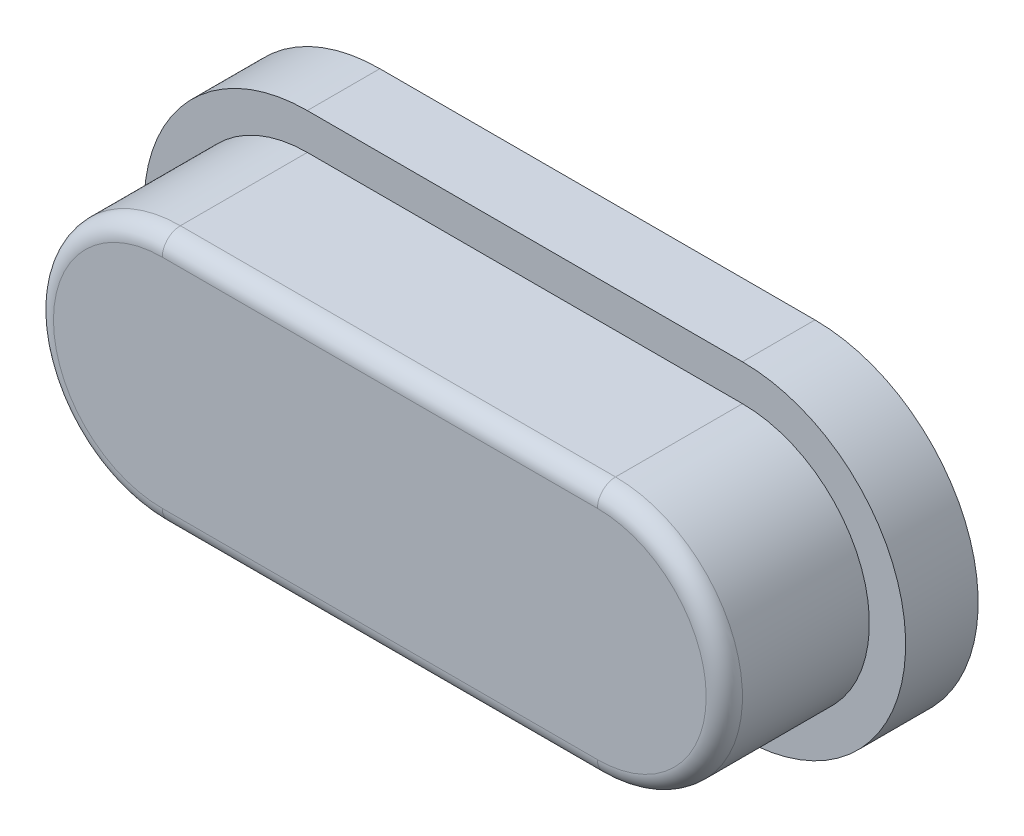
ISO-10303-21;
HEADER;
FILE_DESCRIPTION(('STEP AP214'),'2;1');
FILE_NAME('part.step','',(''),(''),'','','');
FILE_SCHEMA(('AUTOMOTIVE_DESIGN { 1 0 10303 214 1 1 1 1 }'));
ENDSEC;
DATA;
#1=APPLICATION_CONTEXT('core data for automotive mechanical design processes');
#2=APPLICATION_PROTOCOL_DEFINITION('international standard','automotive_design',2000,#1);
#3=PRODUCT_CONTEXT('',#1,'mechanical');
#4=PRODUCT('Part','Part','',(#3));
#5=PRODUCT_RELATED_PRODUCT_CATEGORY('part','',(#4));
#6=PRODUCT_DEFINITION_FORMATION('','',#4);
#7=PRODUCT_DEFINITION_CONTEXT('part definition',#1,'design');
#8=PRODUCT_DEFINITION('design','',#6,#7);
#9=PRODUCT_DEFINITION_SHAPE('','',#8);
#10=(LENGTH_UNIT() NAMED_UNIT(*) SI_UNIT(.MILLI.,.METRE.));
#11=(NAMED_UNIT(*) PLANE_ANGLE_UNIT() SI_UNIT($,.RADIAN.));
#12=(NAMED_UNIT(*) SI_UNIT($,.STERADIAN.) SOLID_ANGLE_UNIT());
#13=UNCERTAINTY_MEASURE_WITH_UNIT(LENGTH_MEASURE(1.E-05),#10,'distance_accuracy_value','');
#14=(GEOMETRIC_REPRESENTATION_CONTEXT(3) GLOBAL_UNCERTAINTY_ASSIGNED_CONTEXT((#13)) GLOBAL_UNIT_ASSIGNED_CONTEXT((#10,
#11,#12)) REPRESENTATION_CONTEXT('',''));
#15=CARTESIAN_POINT('',(0.,0.,0.));
#16=DIRECTION('',(0.,0.,1.));
#17=DIRECTION('',(1.,0.,0.));
#18=AXIS2_PLACEMENT_3D('',#15,#16,#17);
#19=CARTESIAN_POINT('',(-3.,0.,2.));
#20=DIRECTION('',(0.,0.,-1.));
#21=DIRECTION('',(-1.,0.,0.));
#22=AXIS2_PLACEMENT_3D('',#19,#20,#21);
#23=CYLINDRICAL_SURFACE('',#22,1.75);
#24=DIRECTION('',(0.,0.,-1.));
#25=VECTOR('',#24,1.);
#26=CARTESIAN_POINT('',(-3.,-1.75,2.));
#27=LINE('',#26,#25);
#28=CARTESIAN_POINT('',(-3.,-1.75,1.75));
#29=VERTEX_POINT('',#28);
#30=CARTESIAN_POINT('',(-3.,-1.75,0.));
#31=VERTEX_POINT('',#30);
#32=EDGE_CURVE('E171',#29,#31,#27,.T.);
#33=ORIENTED_EDGE('',*,*,#32,.F.);
#34=CARTESIAN_POINT('',(-3.,0.,1.75));
#35=DIRECTION('',(0.,0.,1.));
#36=DIRECTION('',(1.,0.,0.));
#37=AXIS2_PLACEMENT_3D('',#34,#35,#36);
#38=CIRCLE('',#37,1.75);
#39=CARTESIAN_POINT('',(-3.,1.75,1.75));
#40=VERTEX_POINT('',#39);
#41=EDGE_CURVE('E57',#29,#40,#38,.F.);
#42=ORIENTED_EDGE('',*,*,#41,.T.);
#43=DIRECTION('',(0.,0.,-1.));
#44=VECTOR('',#43,1.);
#45=CARTESIAN_POINT('',(-3.,1.75,2.));
#46=LINE('',#45,#44);
#47=CARTESIAN_POINT('',(-3.,1.75,0.));
#48=VERTEX_POINT('',#47);
#49=EDGE_CURVE('E165',#40,#48,#46,.T.);
#50=ORIENTED_EDGE('',*,*,#49,.T.);
#51=CARTESIAN_POINT('',(-3.,0.,0.));
#52=DIRECTION('',(0.,0.,1.));
#53=DIRECTION('',(1.,0.,0.));
#54=AXIS2_PLACEMENT_3D('',#51,#52,#53);
#55=CIRCLE('',#54,1.75);
#56=EDGE_CURVE('E150',#48,#31,#55,.T.);
#57=ORIENTED_EDGE('',*,*,#56,.T.);
#58=EDGE_LOOP('',(#33,#42,#50,#57));
#59=FACE_BOUND('',#58,.T.);
#60=ADVANCED_FACE('F33',(#59),#23,.T.);
#61=CARTESIAN_POINT('',(-3.,-1.75,2.));
#62=DIRECTION('',(0.,1.,0.));
#63=DIRECTION('',(-1.,0.,0.));
#64=AXIS2_PLACEMENT_3D('',#61,#62,#63);
#65=PLANE('',#64);
#66=DIRECTION('',(0.,0.,-1.));
#67=VECTOR('',#66,1.);
#68=CARTESIAN_POINT('',(3.,-1.75,2.));
#69=LINE('',#68,#67);
#70=CARTESIAN_POINT('',(3.,-1.75,1.75));
#71=VERTEX_POINT('',#70);
#72=CARTESIAN_POINT('',(3.,-1.75,0.));
#73=VERTEX_POINT('',#72);
#74=EDGE_CURVE('E169',#71,#73,#69,.T.);
#75=ORIENTED_EDGE('',*,*,#74,.F.);
#76=DIRECTION('',(1.,0.,0.));
#77=VECTOR('',#76,1.);
#78=CARTESIAN_POINT('',(-3.,-1.75,1.75));
#79=LINE('',#78,#77);
#80=EDGE_CURVE('E182',#71,#29,#79,.F.);
#81=ORIENTED_EDGE('',*,*,#80,.T.);
#82=ORIENTED_EDGE('',*,*,#32,.T.);
#83=DIRECTION('',(1.,0.,0.));
#84=VECTOR('',#83,1.);
#85=CARTESIAN_POINT('',(-3.,-1.75,0.));
#86=LINE('',#85,#84);
#87=EDGE_CURVE('E156',#31,#73,#86,.T.);
#88=ORIENTED_EDGE('',*,*,#87,.T.);
#89=EDGE_LOOP('',(#75,#81,#82,#88));
#90=FACE_BOUND('',#89,.T.);
#91=ADVANCED_FACE('F212',(#90),#65,.F.);
#92=CARTESIAN_POINT('',(3.,0.,2.));
#93=DIRECTION('',(0.,0.,-1.));
#94=DIRECTION('',(-1.,0.,0.));
#95=AXIS2_PLACEMENT_3D('',#92,#93,#94);
#96=CYLINDRICAL_SURFACE('',#95,1.75);
#97=DIRECTION('',(0.,0.,-1.));
#98=VECTOR('',#97,1.);
#99=CARTESIAN_POINT('',(3.,1.75,2.));
#100=LINE('',#99,#98);
#101=CARTESIAN_POINT('',(3.,1.75,1.75));
#102=VERTEX_POINT('',#101);
#103=CARTESIAN_POINT('',(3.,1.75,0.));
#104=VERTEX_POINT('',#103);
#105=EDGE_CURVE('E167',#102,#104,#100,.T.);
#106=ORIENTED_EDGE('',*,*,#105,.F.);
#107=CARTESIAN_POINT('',(3.,0.,1.75));
#108=DIRECTION('',(0.,0.,1.));
#109=DIRECTION('',(1.,0.,0.));
#110=AXIS2_PLACEMENT_3D('',#107,#108,#109);
#111=CIRCLE('',#110,1.75);
#112=EDGE_CURVE('E11',#102,#71,#111,.F.);
#113=ORIENTED_EDGE('',*,*,#112,.T.);
#114=ORIENTED_EDGE('',*,*,#74,.T.);
#115=CARTESIAN_POINT('',(3.,0.,0.));
#116=DIRECTION('',(0.,0.,1.));
#117=DIRECTION('',(1.,0.,0.));
#118=AXIS2_PLACEMENT_3D('',#115,#116,#117);
#119=CIRCLE('',#118,1.75);
#120=EDGE_CURVE('E159',#73,#104,#119,.T.);
#121=ORIENTED_EDGE('',*,*,#120,.T.);
#122=EDGE_LOOP('',(#106,#113,#114,#121));
#123=FACE_BOUND('',#122,.T.);
#124=ADVANCED_FACE('F208',(#123),#96,.T.);
#125=CARTESIAN_POINT('',(-3.,1.75,2.));
#126=DIRECTION('',(0.,-1.,0.));
#127=DIRECTION('',(1.,0.,0.));
#128=AXIS2_PLACEMENT_3D('',#125,#126,#127);
#129=PLANE('',#128);
#130=ORIENTED_EDGE('',*,*,#49,.F.);
#131=DIRECTION('',(-1.,0.,0.));
#132=VECTOR('',#131,1.);
#133=CARTESIAN_POINT('',(3.,1.75,1.75));
#134=LINE('',#133,#132);
#135=EDGE_CURVE('E42',#40,#102,#134,.F.);
#136=ORIENTED_EDGE('',*,*,#135,.T.);
#137=ORIENTED_EDGE('',*,*,#105,.T.);
#138=DIRECTION('',(-1.,0.,0.));
#139=VECTOR('',#138,1.);
#140=CARTESIAN_POINT('',(-3.,1.75,0.));
#141=LINE('',#140,#139);
#142=EDGE_CURVE('E162',#104,#48,#141,.T.);
#143=ORIENTED_EDGE('',*,*,#142,.T.);
#144=EDGE_LOOP('',(#130,#136,#137,#143));
#145=FACE_BOUND('',#144,.T.);
#146=ADVANCED_FACE('F221',(#145),#129,.F.);
#147=CARTESIAN_POINT('',(-3.,0.,2.));
#148=DIRECTION('',(0.,0.,1.));
#149=DIRECTION('',(1.,0.,0.));
#150=AXIS2_PLACEMENT_3D('',#147,#148,#149);
#151=PLANE('',#150);
#152=CARTESIAN_POINT('',(-3.,0.,2.));
#153=DIRECTION('',(0.,0.,1.));
#154=DIRECTION('',(1.,0.,0.));
#155=AXIS2_PLACEMENT_3D('',#152,#153,#154);
#156=CIRCLE('',#155,1.5);
#157=CARTESIAN_POINT('',(-3.,1.5,2.));
#158=VERTEX_POINT('',#157);
#159=CARTESIAN_POINT('',(-3.,-1.5,2.));
#160=VERTEX_POINT('',#159);
#161=EDGE_CURVE('E177',#158,#160,#156,.T.);
#162=ORIENTED_EDGE('',*,*,#161,.T.);
#163=DIRECTION('',(1.,0.,0.));
#164=VECTOR('',#163,1.);
#165=CARTESIAN_POINT('',(3.,-1.5,2.));
#166=LINE('',#165,#164);
#167=CARTESIAN_POINT('',(3.,-1.5,2.));
#168=VERTEX_POINT('',#167);
#169=EDGE_CURVE('E179',#160,#168,#166,.T.);
#170=ORIENTED_EDGE('',*,*,#169,.T.);
#171=CARTESIAN_POINT('',(3.,0.,2.));
#172=DIRECTION('',(0.,0.,1.));
#173=DIRECTION('',(1.,0.,0.));
#174=AXIS2_PLACEMENT_3D('',#171,#172,#173);
#175=CIRCLE('',#174,1.5);
#176=CARTESIAN_POINT('',(3.,1.5,2.));
#177=VERTEX_POINT('',#176);
#178=EDGE_CURVE('E173',#168,#177,#175,.T.);
#179=ORIENTED_EDGE('',*,*,#178,.T.);
#180=DIRECTION('',(-1.,0.,0.));
#181=VECTOR('',#180,1.);
#182=CARTESIAN_POINT('',(-3.,1.5,2.));
#183=LINE('',#182,#181);
#184=EDGE_CURVE('E175',#177,#158,#183,.T.);
#185=ORIENTED_EDGE('',*,*,#184,.T.);
#186=EDGE_LOOP('',(#162,#170,#179,#185));
#187=FACE_BOUND('',#186,.T.);
#188=ADVANCED_FACE('F218',(#187),#151,.T.);
#189=CARTESIAN_POINT('',(-3.,0.,0.));
#190=DIRECTION('',(0.,0.,1.));
#191=DIRECTION('',(1.,0.,0.));
#192=AXIS2_PLACEMENT_3D('',#189,#190,#191);
#193=PLANE('',#192);
#194=CARTESIAN_POINT('',(-3.,0.,0.));
#195=DIRECTION('',(0.,0.,1.));
#196=DIRECTION('',(1.,0.,0.));
#197=AXIS2_PLACEMENT_3D('',#194,#195,#196);
#198=CIRCLE('',#197,2.25);
#199=CARTESIAN_POINT('',(-3.,2.25,0.));
#200=VERTEX_POINT('',#199);
#201=CARTESIAN_POINT('',(-3.,-2.25,0.));
#202=VERTEX_POINT('',#201);
#203=EDGE_CURVE('E144',#200,#202,#198,.T.);
#204=ORIENTED_EDGE('',*,*,#203,.T.);
#205=DIRECTION('',(1.,0.,0.));
#206=VECTOR('',#205,1.);
#207=CARTESIAN_POINT('',(-3.,-2.25,0.));
#208=LINE('',#207,#206);
#209=CARTESIAN_POINT('',(3.,-2.25,0.));
#210=VERTEX_POINT('',#209);
#211=EDGE_CURVE('E116',#202,#210,#208,.T.);
#212=ORIENTED_EDGE('',*,*,#211,.T.);
#213=CARTESIAN_POINT('',(3.,0.,0.));
#214=DIRECTION('',(0.,0.,1.));
#215=DIRECTION('',(1.,0.,0.));
#216=AXIS2_PLACEMENT_3D('',#213,#214,#215);
#217=CIRCLE('',#216,2.25);
#218=CARTESIAN_POINT('',(3.,2.25,0.));
#219=VERTEX_POINT('',#218);
#220=EDGE_CURVE('E139',#210,#219,#217,.T.);
#221=ORIENTED_EDGE('',*,*,#220,.T.);
#222=DIRECTION('',(-1.,0.,0.));
#223=VECTOR('',#222,1.);
#224=CARTESIAN_POINT('',(-3.,2.25,0.));
#225=LINE('',#224,#223);
#226=EDGE_CURVE('E136',#219,#200,#225,.T.);
#227=ORIENTED_EDGE('',*,*,#226,.T.);
#228=EDGE_LOOP('',(#204,#212,#221,#227));
#229=FACE_BOUND('',#228,.T.);
#230=ORIENTED_EDGE('',*,*,#56,.F.);
#231=ORIENTED_EDGE('',*,*,#142,.F.);
#232=ORIENTED_EDGE('',*,*,#120,.F.);
#233=ORIENTED_EDGE('',*,*,#87,.F.);
#234=EDGE_LOOP('',(#230,#231,#232,#233));
#235=FACE_BOUND('',#234,.T.);
#236=ADVANCED_FACE('F220',(#229,#235),#193,.T.);
#237=CARTESIAN_POINT('',(-3.,0.,-1.));
#238=DIRECTION('',(0.,0.,1.));
#239=DIRECTION('',(1.,0.,0.));
#240=AXIS2_PLACEMENT_3D('',#237,#238,#239);
#241=CYLINDRICAL_SURFACE('',#240,2.25);
#242=ORIENTED_EDGE('',*,*,#203,.F.);
#243=DIRECTION('',(0.,0.,1.));
#244=VECTOR('',#243,1.);
#245=CARTESIAN_POINT('',(-3.,2.25,-1.));
#246=LINE('',#245,#244);
#247=CARTESIAN_POINT('',(-3.,2.25,-1.));
#248=VERTEX_POINT('',#247);
#249=EDGE_CURVE('E135',#248,#200,#246,.T.);
#250=ORIENTED_EDGE('',*,*,#249,.F.);
#251=CARTESIAN_POINT('',(-3.,0.,-1.));
#252=DIRECTION('',(0.,0.,1.));
#253=DIRECTION('',(1.,0.,0.));
#254=AXIS2_PLACEMENT_3D('',#251,#252,#253);
#255=CIRCLE('',#254,2.25);
#256=CARTESIAN_POINT('',(-3.,-2.25,-1.));
#257=VERTEX_POINT('',#256);
#258=EDGE_CURVE('E129',#248,#257,#255,.T.);
#259=ORIENTED_EDGE('',*,*,#258,.T.);
#260=DIRECTION('',(0.,0.,1.));
#261=VECTOR('',#260,1.);
#262=CARTESIAN_POINT('',(-3.,-2.25,-1.));
#263=LINE('',#262,#261);
#264=EDGE_CURVE('E111',#257,#202,#263,.T.);
#265=ORIENTED_EDGE('',*,*,#264,.T.);
#266=EDGE_LOOP('',(#242,#250,#259,#265));
#267=FACE_BOUND('',#266,.T.);
#268=ADVANCED_FACE('F134',(#267),#241,.T.);
#269=CARTESIAN_POINT('',(-3.,2.25,-1.));
#270=DIRECTION('',(0.,1.,0.));
#271=DIRECTION('',(-1.,0.,0.));
#272=AXIS2_PLACEMENT_3D('',#269,#270,#271);
#273=PLANE('',#272);
#274=ORIENTED_EDGE('',*,*,#226,.F.);
#275=DIRECTION('',(0.,0.,1.));
#276=VECTOR('',#275,1.);
#277=CARTESIAN_POINT('',(3.,2.25,-1.));
#278=LINE('',#277,#276);
#279=CARTESIAN_POINT('',(3.,2.25,-1.));
#280=VERTEX_POINT('',#279);
#281=EDGE_CURVE('E151',#280,#219,#278,.T.);
#282=ORIENTED_EDGE('',*,*,#281,.F.);
#283=DIRECTION('',(-1.,0.,0.));
#284=VECTOR('',#283,1.);
#285=CARTESIAN_POINT('',(-3.,2.25,-1.));
#286=LINE('',#285,#284);
#287=EDGE_CURVE('E122',#280,#248,#286,.T.);
#288=ORIENTED_EDGE('',*,*,#287,.T.);
#289=ORIENTED_EDGE('',*,*,#249,.T.);
#290=EDGE_LOOP('',(#274,#282,#288,#289));
#291=FACE_BOUND('',#290,.T.);
#292=ADVANCED_FACE('F256',(#291),#273,.T.);
#293=CARTESIAN_POINT('',(3.,0.,-1.));
#294=DIRECTION('',(0.,0.,1.));
#295=DIRECTION('',(1.,0.,0.));
#296=AXIS2_PLACEMENT_3D('',#293,#294,#295);
#297=CYLINDRICAL_SURFACE('',#296,2.25);
#298=ORIENTED_EDGE('',*,*,#220,.F.);
#299=DIRECTION('',(0.,0.,1.));
#300=VECTOR('',#299,1.);
#301=CARTESIAN_POINT('',(3.,-2.25,-1.));
#302=LINE('',#301,#300);
#303=CARTESIAN_POINT('',(3.,-2.25,-1.));
#304=VERTEX_POINT('',#303);
#305=EDGE_CURVE('E121',#304,#210,#302,.T.);
#306=ORIENTED_EDGE('',*,*,#305,.F.);
#307=CARTESIAN_POINT('',(3.,0.,-1.));
#308=DIRECTION('',(0.,0.,1.));
#309=DIRECTION('',(1.,0.,0.));
#310=AXIS2_PLACEMENT_3D('',#307,#308,#309);
#311=CIRCLE('',#310,2.25);
#312=EDGE_CURVE('E132',#304,#280,#311,.T.);
#313=ORIENTED_EDGE('',*,*,#312,.T.);
#314=ORIENTED_EDGE('',*,*,#281,.T.);
#315=EDGE_LOOP('',(#298,#306,#313,#314));
#316=FACE_BOUND('',#315,.T.);
#317=ADVANCED_FACE('F253',(#316),#297,.T.);
#318=CARTESIAN_POINT('',(-3.,-2.25,-1.));
#319=DIRECTION('',(0.,-1.,0.));
#320=DIRECTION('',(1.,0.,0.));
#321=AXIS2_PLACEMENT_3D('',#318,#319,#320);
#322=PLANE('',#321);
#323=ORIENTED_EDGE('',*,*,#211,.F.);
#324=ORIENTED_EDGE('',*,*,#264,.F.);
#325=DIRECTION('',(1.,0.,0.));
#326=VECTOR('',#325,1.);
#327=CARTESIAN_POINT('',(-3.,-2.25,-1.));
#328=LINE('',#327,#326);
#329=EDGE_CURVE('E114',#257,#304,#328,.T.);
#330=ORIENTED_EDGE('',*,*,#329,.T.);
#331=ORIENTED_EDGE('',*,*,#305,.T.);
#332=EDGE_LOOP('',(#323,#324,#330,#331));
#333=FACE_BOUND('',#332,.T.);
#334=ADVANCED_FACE('F113',(#333),#322,.T.);
#335=CARTESIAN_POINT('',(-3.,0.,-1.));
#336=DIRECTION('',(0.,0.,1.));
#337=DIRECTION('',(1.,0.,0.));
#338=AXIS2_PLACEMENT_3D('',#335,#336,#337);
#339=PLANE('',#338);
#340=ORIENTED_EDGE('',*,*,#258,.F.);
#341=ORIENTED_EDGE('',*,*,#287,.F.);
#342=ORIENTED_EDGE('',*,*,#312,.F.);
#343=ORIENTED_EDGE('',*,*,#329,.F.);
#344=EDGE_LOOP('',(#340,#341,#342,#343));
#345=FACE_BOUND('',#344,.T.);
#346=ADVANCED_FACE('F127',(#345),#339,.F.);
#347=CARTESIAN_POINT('',(-3.,1.5,1.75));
#348=DIRECTION('',(1.,0.,0.));
#349=DIRECTION('',(0.,1.,0.));
#350=AXIS2_PLACEMENT_3D('',#347,#348,#349);
#351=CYLINDRICAL_SURFACE('',#350,0.25);
#352=CARTESIAN_POINT('',(3.,1.5,1.75));
#353=DIRECTION('',(1.,0.,0.));
#354=DIRECTION('',(0.,0.,-1.));
#355=AXIS2_PLACEMENT_3D('',#352,#353,#354);
#356=CIRCLE('',#355,0.25);
#357=EDGE_CURVE('E190',#102,#177,#356,.T.);
#358=ORIENTED_EDGE('',*,*,#357,.F.);
#359=ORIENTED_EDGE('',*,*,#135,.F.);
#360=CARTESIAN_POINT('',(-3.,1.5,1.75));
#361=DIRECTION('',(-1.,0.,0.));
#362=DIRECTION('',(0.,0.,1.));
#363=AXIS2_PLACEMENT_3D('',#360,#361,#362);
#364=CIRCLE('',#363,0.25);
#365=EDGE_CURVE('E37',#158,#40,#364,.T.);
#366=ORIENTED_EDGE('',*,*,#365,.F.);
#367=ORIENTED_EDGE('',*,*,#184,.F.);
#368=EDGE_LOOP('',(#358,#359,#366,#367));
#369=FACE_BOUND('',#368,.T.);
#370=ADVANCED_FACE('F35',(#369),#351,.T.);
#371=CARTESIAN_POINT('',(-3.,0.,1.75));
#372=DIRECTION('',(0.,0.,1.));
#373=DIRECTION('',(1.,0.,0.));
#374=AXIS2_PLACEMENT_3D('',#371,#372,#373);
#375=TOROIDAL_SURFACE('',#374,1.5,0.25);
#376=ORIENTED_EDGE('',*,*,#365,.T.);
#377=ORIENTED_EDGE('',*,*,#41,.F.);
#378=CARTESIAN_POINT('',(-3.,-1.5,1.75));
#379=DIRECTION('',(1.,0.,0.));
#380=DIRECTION('',(0.,0.,-1.));
#381=AXIS2_PLACEMENT_3D('',#378,#379,#380);
#382=CIRCLE('',#381,0.25);
#383=EDGE_CURVE('E189',#160,#29,#382,.T.);
#384=ORIENTED_EDGE('',*,*,#383,.F.);
#385=ORIENTED_EDGE('',*,*,#161,.F.);
#386=EDGE_LOOP('',(#376,#377,#384,#385));
#387=FACE_BOUND('',#386,.T.);
#388=ADVANCED_FACE('F200',(#387),#375,.T.);
#389=CARTESIAN_POINT('',(3.,0.,1.75));
#390=DIRECTION('',(0.,0.,1.));
#391=DIRECTION('',(1.,0.,0.));
#392=AXIS2_PLACEMENT_3D('',#389,#390,#391);
#393=TOROIDAL_SURFACE('',#392,1.5,0.25);
#394=ORIENTED_EDGE('',*,*,#357,.T.);
#395=ORIENTED_EDGE('',*,*,#178,.F.);
#396=CARTESIAN_POINT('',(3.,-1.5,1.75));
#397=DIRECTION('',(-1.,0.,0.));
#398=DIRECTION('',(0.,0.,1.));
#399=AXIS2_PLACEMENT_3D('',#396,#397,#398);
#400=CIRCLE('',#399,0.25);
#401=EDGE_CURVE('E187',#71,#168,#400,.T.);
#402=ORIENTED_EDGE('',*,*,#401,.F.);
#403=ORIENTED_EDGE('',*,*,#112,.F.);
#404=EDGE_LOOP('',(#394,#395,#402,#403));
#405=FACE_BOUND('',#404,.T.);
#406=ADVANCED_FACE('F205',(#405),#393,.T.);
#407=CARTESIAN_POINT('',(-3.,-1.5,1.75));
#408=DIRECTION('',(-1.,0.,0.));
#409=DIRECTION('',(0.,-1.,0.));
#410=AXIS2_PLACEMENT_3D('',#407,#408,#409);
#411=CYLINDRICAL_SURFACE('',#410,0.25);
#412=ORIENTED_EDGE('',*,*,#383,.T.);
#413=ORIENTED_EDGE('',*,*,#80,.F.);
#414=ORIENTED_EDGE('',*,*,#401,.T.);
#415=ORIENTED_EDGE('',*,*,#169,.F.);
#416=EDGE_LOOP('',(#412,#413,#414,#415));
#417=FACE_BOUND('',#416,.T.);
#418=ADVANCED_FACE('F215',(#417),#411,.T.);
#419=CLOSED_SHELL('',(#60,#91,#124,#146,#188,#236,#268,#292,#317,#334,#346,#370,#388,#406,#418));
#420=MANIFOLD_SOLID_BREP('B2',#419);
#421=ADVANCED_BREP_SHAPE_REPRESENTATION('',(#18,#420),#14);
#422=SHAPE_DEFINITION_REPRESENTATION(#9,#421);
ENDSEC;
END-ISO-10303-21;
